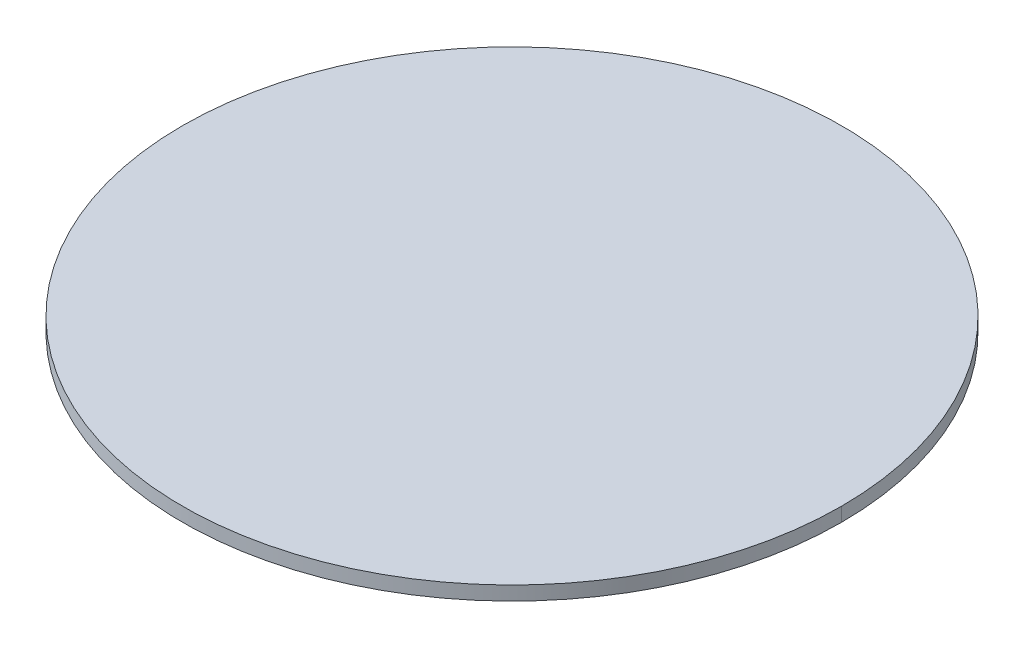
ISO-10303-21;
HEADER;
FILE_DESCRIPTION(('STEP AP214'),'2;1');
FILE_NAME('part.step','',(''),(''),'','','');
FILE_SCHEMA(('AUTOMOTIVE_DESIGN { 1 0 10303 214 1 1 1 1 }'));
ENDSEC;
DATA;
#1=APPLICATION_CONTEXT('core data for automotive mechanical design processes');
#2=APPLICATION_PROTOCOL_DEFINITION('international standard','automotive_design',2000,#1);
#3=PRODUCT_CONTEXT('',#1,'mechanical');
#4=PRODUCT('Part','Part','',(#3));
#5=PRODUCT_RELATED_PRODUCT_CATEGORY('part','',(#4));
#6=PRODUCT_DEFINITION_FORMATION('','',#4);
#7=PRODUCT_DEFINITION_CONTEXT('part definition',#1,'design');
#8=PRODUCT_DEFINITION('design','',#6,#7);
#9=PRODUCT_DEFINITION_SHAPE('','',#8);
#10=(LENGTH_UNIT() NAMED_UNIT(*) SI_UNIT(.MILLI.,.METRE.));
#11=(NAMED_UNIT(*) PLANE_ANGLE_UNIT() SI_UNIT($,.RADIAN.));
#12=(NAMED_UNIT(*) SI_UNIT($,.STERADIAN.) SOLID_ANGLE_UNIT());
#13=UNCERTAINTY_MEASURE_WITH_UNIT(LENGTH_MEASURE(1.E-05),#10,'distance_accuracy_value','');
#14=(GEOMETRIC_REPRESENTATION_CONTEXT(3) GLOBAL_UNCERTAINTY_ASSIGNED_CONTEXT((#13)) GLOBAL_UNIT_ASSIGNED_CONTEXT((#10,
#11,#12)) REPRESENTATION_CONTEXT('',''));
#15=CARTESIAN_POINT('',(0.,0.,0.));
#16=DIRECTION('',(0.,0.,1.));
#17=DIRECTION('',(1.,0.,0.));
#18=AXIS2_PLACEMENT_3D('',#15,#16,#17);
#19=CARTESIAN_POINT('',(0.,0.,0.));
#20=DIRECTION('',(0.,1.,0.));
#21=DIRECTION('',(0.,0.,1.));
#22=AXIS2_PLACEMENT_3D('',#19,#20,#21);
#23=PLANE('',#22);
#24=CARTESIAN_POINT('',(0.,0.,0.));
#25=DIRECTION('',(0.,1.,0.));
#26=DIRECTION('',(1.,0.,0.));
#27=AXIS2_PLACEMENT_3D('',#24,#25,#26);
#28=CIRCLE('',#27,2.9972);
#29=CARTESIAN_POINT('',(2.9972,0.,0.));
#30=VERTEX_POINT('',#29);
#31=CARTESIAN_POINT('',(-2.9972,0.,0.));
#32=VERTEX_POINT('',#31);
#33=EDGE_CURVE('E11',#30,#32,#28,.T.);
#34=ORIENTED_EDGE('',*,*,#33,.F.);
#35=CARTESIAN_POINT('',(0.,0.,0.));
#36=DIRECTION('',(0.,1.,0.));
#37=DIRECTION('',(1.,0.,0.));
#38=AXIS2_PLACEMENT_3D('',#35,#36,#37);
#39=CIRCLE('',#38,2.9972);
#40=EDGE_CURVE('E25',#32,#30,#39,.T.);
#41=ORIENTED_EDGE('',*,*,#40,.F.);
#42=EDGE_LOOP('',(#34,#41));
#43=FACE_BOUND('',#42,.T.);
#44=ADVANCED_FACE('F17',(#43),#23,.F.);
#45=CARTESIAN_POINT('',(0.,0.127,0.));
#46=DIRECTION('',(0.,1.,0.));
#47=DIRECTION('',(0.,0.,-1.));
#48=AXIS2_PLACEMENT_3D('',#45,#46,#47);
#49=CYLINDRICAL_SURFACE('',#48,2.9972);
#50=ORIENTED_EDGE('',*,*,#40,.T.);
#51=DIRECTION('',(0.,1.,0.));
#52=VECTOR('',#51,1.);
#53=CARTESIAN_POINT('',(2.9972,0.,0.));
#54=LINE('',#53,#52);
#55=CARTESIAN_POINT('',(2.9972,0.127,0.));
#56=VERTEX_POINT('',#55);
#57=EDGE_CURVE('E45',#30,#56,#54,.T.);
#58=ORIENTED_EDGE('',*,*,#57,.T.);
#59=CARTESIAN_POINT('',(0.,0.127,0.));
#60=DIRECTION('',(0.,1.,0.));
#61=DIRECTION('',(1.,0.,0.));
#62=AXIS2_PLACEMENT_3D('',#59,#60,#61);
#63=CIRCLE('',#62,2.9972);
#64=CARTESIAN_POINT('',(-2.9972,0.127,0.));
#65=VERTEX_POINT('',#64);
#66=EDGE_CURVE('E40',#65,#56,#63,.T.);
#67=ORIENTED_EDGE('',*,*,#66,.F.);
#68=DIRECTION('',(0.,1.,0.));
#69=VECTOR('',#68,1.);
#70=CARTESIAN_POINT('',(-2.9972,0.,0.));
#71=LINE('',#70,#69);
#72=EDGE_CURVE('E43',#32,#65,#71,.T.);
#73=ORIENTED_EDGE('',*,*,#72,.F.);
#74=EDGE_LOOP('',(#50,#58,#67,#73));
#75=FACE_BOUND('',#74,.T.);
#76=ADVANCED_FACE('F42',(#75),#49,.T.);
#77=CARTESIAN_POINT('',(0.,0.127,0.));
#78=DIRECTION('',(0.,1.,0.));
#79=DIRECTION('',(0.,0.,1.));
#80=AXIS2_PLACEMENT_3D('',#77,#78,#79);
#81=CYLINDRICAL_SURFACE('',#80,2.9972);
#82=CARTESIAN_POINT('',(0.,0.127,0.));
#83=DIRECTION('',(0.,1.,0.));
#84=DIRECTION('',(1.,0.,0.));
#85=AXIS2_PLACEMENT_3D('',#82,#83,#84);
#86=CIRCLE('',#85,2.9972);
#87=EDGE_CURVE('E52',#56,#65,#86,.T.);
#88=ORIENTED_EDGE('',*,*,#87,.F.);
#89=ORIENTED_EDGE('',*,*,#57,.F.);
#90=ORIENTED_EDGE('',*,*,#33,.T.);
#91=ORIENTED_EDGE('',*,*,#72,.T.);
#92=EDGE_LOOP('',(#88,#89,#90,#91));
#93=FACE_BOUND('',#92,.T.);
#94=ADVANCED_FACE('F51',(#93),#81,.T.);
#95=CARTESIAN_POINT('',(0.,0.127,0.));
#96=DIRECTION('',(0.,1.,0.));
#97=DIRECTION('',(0.,0.,1.));
#98=AXIS2_PLACEMENT_3D('',#95,#96,#97);
#99=PLANE('',#98);
#100=ORIENTED_EDGE('',*,*,#87,.T.);
#101=ORIENTED_EDGE('',*,*,#66,.T.);
#102=EDGE_LOOP('',(#100,#101));
#103=FACE_BOUND('',#102,.T.);
#104=ADVANCED_FACE('F54',(#103),#99,.T.);
#105=CLOSED_SHELL('',(#44,#76,#94,#104));
#106=MANIFOLD_SOLID_BREP('B1',#105);
#107=ADVANCED_BREP_SHAPE_REPRESENTATION('',(#18,#106),#14);
#108=SHAPE_DEFINITION_REPRESENTATION(#9,#107);
ENDSEC;
END-ISO-10303-21;
